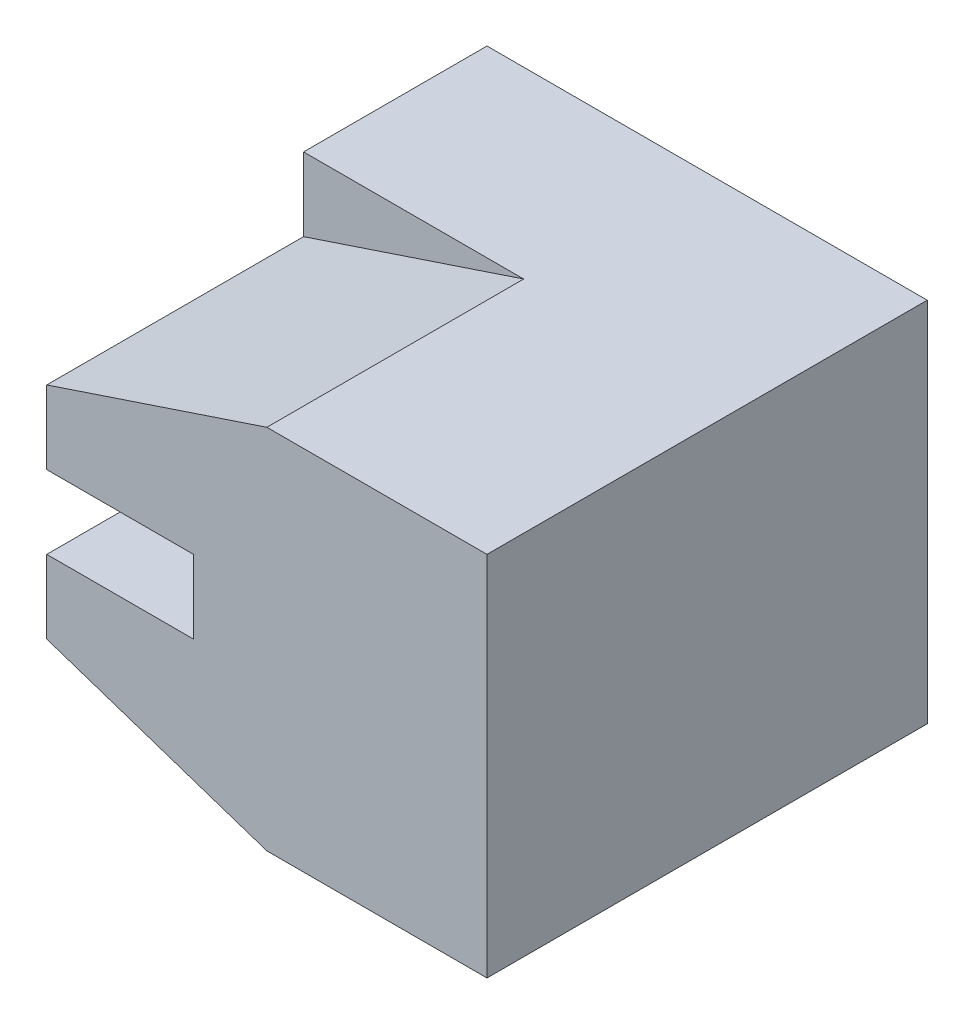
ISO-10303-21;
HEADER;
FILE_DESCRIPTION(('STEP AP214'),'2;1');
FILE_NAME('part.step','',(''),(''),'','','');
FILE_SCHEMA(('AUTOMOTIVE_DESIGN { 1 0 10303 214 1 1 1 1 }'));
ENDSEC;
DATA;
#1=APPLICATION_CONTEXT('core data for automotive mechanical design processes');
#2=APPLICATION_PROTOCOL_DEFINITION('international standard','automotive_design',2000,#1);
#3=PRODUCT_CONTEXT('',#1,'mechanical');
#4=PRODUCT('Part','Part','',(#3));
#5=PRODUCT_RELATED_PRODUCT_CATEGORY('part','',(#4));
#6=PRODUCT_DEFINITION_FORMATION('','',#4);
#7=PRODUCT_DEFINITION_CONTEXT('part definition',#1,'design');
#8=PRODUCT_DEFINITION('design','',#6,#7);
#9=PRODUCT_DEFINITION_SHAPE('','',#8);
#10=(LENGTH_UNIT() NAMED_UNIT(*) SI_UNIT(.MILLI.,.METRE.));
#11=(NAMED_UNIT(*) PLANE_ANGLE_UNIT() SI_UNIT($,.RADIAN.));
#12=(NAMED_UNIT(*) SI_UNIT($,.STERADIAN.) SOLID_ANGLE_UNIT());
#13=UNCERTAINTY_MEASURE_WITH_UNIT(LENGTH_MEASURE(1.E-05),#10,'distance_accuracy_value','');
#14=(GEOMETRIC_REPRESENTATION_CONTEXT(3) GLOBAL_UNCERTAINTY_ASSIGNED_CONTEXT((#13)) GLOBAL_UNIT_ASSIGNED_CONTEXT((#10,
#11,#12)) REPRESENTATION_CONTEXT('',''));
#15=CARTESIAN_POINT('',(0.,0.,0.));
#16=DIRECTION('',(0.,0.,1.));
#17=DIRECTION('',(1.,0.,0.));
#18=AXIS2_PLACEMENT_3D('',#15,#16,#17);
#19=CARTESIAN_POINT('',(-3.,5.,3.));
#20=DIRECTION('',(1.,0.,0.));
#21=DIRECTION('',(0.,0.,-1.));
#22=AXIS2_PLACEMENT_3D('',#19,#20,#21);
#23=PLANE('',#22);
#24=DIRECTION('',(0.,-1.,0.));
#25=VECTOR('',#24,1.);
#26=CARTESIAN_POINT('',(-3.,5.,3.));
#27=LINE('',#26,#25);
#28=CARTESIAN_POINT('',(-3.,4.,3.));
#29=VERTEX_POINT('',#28);
#30=CARTESIAN_POINT('',(-3.,3.,3.));
#31=VERTEX_POINT('',#30);
#32=EDGE_CURVE('E141',#29,#31,#27,.T.);
#33=ORIENTED_EDGE('',*,*,#32,.F.);
#34=DIRECTION('',(0.,0.,1.));
#35=VECTOR('',#34,1.);
#36=CARTESIAN_POINT('',(-3.,4.,-0.5));
#37=LINE('',#36,#35);
#38=CARTESIAN_POINT('',(-3.,4.,-0.5));
#39=VERTEX_POINT('',#38);
#40=EDGE_CURVE('E124',#39,#29,#37,.T.);
#41=ORIENTED_EDGE('',*,*,#40,.F.);
#42=DIRECTION('',(0.,-1.,0.));
#43=VECTOR('',#42,1.);
#44=CARTESIAN_POINT('',(-3.,0.,-0.5));
#45=LINE('',#44,#43);
#46=CARTESIAN_POINT('',(-3.,5.,-0.5));
#47=VERTEX_POINT('',#46);
#48=EDGE_CURVE('E130',#47,#39,#45,.T.);
#49=ORIENTED_EDGE('',*,*,#48,.F.);
#50=DIRECTION('',(0.,0.,1.));
#51=VECTOR('',#50,1.);
#52=CARTESIAN_POINT('',(-3.,5.,3.));
#53=LINE('',#52,#51);
#54=CARTESIAN_POINT('',(-3.,5.,-3.));
#55=VERTEX_POINT('',#54);
#56=EDGE_CURVE('E192',#55,#47,#53,.T.);
#57=ORIENTED_EDGE('',*,*,#56,.F.);
#58=DIRECTION('',(0.,-1.,0.));
#59=VECTOR('',#58,1.);
#60=CARTESIAN_POINT('',(-3.,5.,-3.));
#61=LINE('',#60,#59);
#62=CARTESIAN_POINT('',(-3.,0.,-3.));
#63=VERTEX_POINT('',#62);
#64=EDGE_CURVE('E41',#55,#63,#61,.T.);
#65=ORIENTED_EDGE('',*,*,#64,.T.);
#66=DIRECTION('',(0.,0.,1.));
#67=VECTOR('',#66,1.);
#68=CARTESIAN_POINT('',(-3.,0.,3.));
#69=LINE('',#68,#67);
#70=CARTESIAN_POINT('',(-3.,0.,-0.5));
#71=VERTEX_POINT('',#70);
#72=EDGE_CURVE('E201',#63,#71,#69,.T.);
#73=ORIENTED_EDGE('',*,*,#72,.T.);
#74=DIRECTION('',(0.,-1.,0.));
#75=VECTOR('',#74,1.);
#76=CARTESIAN_POINT('',(-3.,0.,-0.5));
#77=LINE('',#76,#75);
#78=CARTESIAN_POINT('',(-3.,1.,-0.5));
#79=VERTEX_POINT('',#78);
#80=EDGE_CURVE('E56',#79,#71,#77,.T.);
#81=ORIENTED_EDGE('',*,*,#80,.F.);
#82=DIRECTION('',(0.,0.,1.));
#83=VECTOR('',#82,1.);
#84=CARTESIAN_POINT('',(-3.,1.,-0.5));
#85=LINE('',#84,#83);
#86=CARTESIAN_POINT('',(-3.,1.,3.));
#87=VERTEX_POINT('',#86);
#88=EDGE_CURVE('E156',#79,#87,#85,.T.);
#89=ORIENTED_EDGE('',*,*,#88,.T.);
#90=CARTESIAN_POINT('',(-3.,2.,3.));
#91=VERTEX_POINT('',#90);
#92=EDGE_CURVE('E207',#91,#87,#27,.T.);
#93=ORIENTED_EDGE('',*,*,#92,.F.);
#94=DIRECTION('',(0.,0.,1.));
#95=VECTOR('',#94,1.);
#96=CARTESIAN_POINT('',(-3.,2.,0.));
#97=LINE('',#96,#95);
#98=CARTESIAN_POINT('',(-3.,2.,-0.500000000000001));
#99=VERTEX_POINT('',#98);
#100=EDGE_CURVE('E163',#99,#91,#97,.T.);
#101=ORIENTED_EDGE('',*,*,#100,.F.);
#102=DIRECTION('',(0.,1.,0.));
#103=VECTOR('',#102,1.);
#104=CARTESIAN_POINT('',(-3.,0.,-0.500000000000001));
#105=LINE('',#104,#103);
#106=CARTESIAN_POINT('',(-3.,3.,-0.500000000000001));
#107=VERTEX_POINT('',#106);
#108=EDGE_CURVE('E172',#99,#107,#105,.T.);
#109=ORIENTED_EDGE('',*,*,#108,.T.);
#110=DIRECTION('',(0.,0.,1.));
#111=VECTOR('',#110,1.);
#112=CARTESIAN_POINT('',(-3.,3.,0.));
#113=LINE('',#112,#111);
#114=EDGE_CURVE('E143',#107,#31,#113,.T.);
#115=ORIENTED_EDGE('',*,*,#114,.T.);
#116=EDGE_LOOP('',(#33,#41,#49,#57,#65,#73,#81,#89,#93,#101,#109,#115));
#117=FACE_BOUND('',#116,.T.);
#118=ADVANCED_FACE('F33',(#117),#23,.F.);
#119=CARTESIAN_POINT('',(-3.,5.,3.));
#120=DIRECTION('',(0.,0.,-1.));
#121=DIRECTION('',(-1.,0.,0.));
#122=AXIS2_PLACEMENT_3D('',#119,#120,#121);
#123=PLANE('',#122);
#124=DIRECTION('',(1.,0.,0.));
#125=VECTOR('',#124,1.);
#126=CARTESIAN_POINT('',(-3.,5.,3.));
#127=LINE('',#126,#125);
#128=CARTESIAN_POINT('',(0.,5.,3.));
#129=VERTEX_POINT('',#128);
#130=CARTESIAN_POINT('',(3.,5.,3.));
#131=VERTEX_POINT('',#130);
#132=EDGE_CURVE('E194',#129,#131,#127,.T.);
#133=ORIENTED_EDGE('',*,*,#132,.F.);
#134=DIRECTION('',(0.948683298050514,0.316227766016838,0.));
#135=VECTOR('',#134,1.);
#136=CARTESIAN_POINT('',(-1.5,4.5,3.));
#137=LINE('',#136,#135);
#138=EDGE_CURVE('E137',#29,#129,#137,.T.);
#139=ORIENTED_EDGE('',*,*,#138,.F.);
#140=ORIENTED_EDGE('',*,*,#32,.T.);
#141=DIRECTION('',(-1.,0.,0.));
#142=VECTOR('',#141,1.);
#143=CARTESIAN_POINT('',(-1.,3.,3.));
#144=LINE('',#143,#142);
#145=CARTESIAN_POINT('',(-1.,3.,3.));
#146=VERTEX_POINT('',#145);
#147=EDGE_CURVE('E176',#146,#31,#144,.T.);
#148=ORIENTED_EDGE('',*,*,#147,.F.);
#149=DIRECTION('',(0.,1.,0.));
#150=VECTOR('',#149,1.);
#151=CARTESIAN_POINT('',(-1.,0.,3.));
#152=LINE('',#151,#150);
#153=CARTESIAN_POINT('',(-1.,2.,3.));
#154=VERTEX_POINT('',#153);
#155=EDGE_CURVE('E167',#154,#146,#152,.T.);
#156=ORIENTED_EDGE('',*,*,#155,.F.);
#157=DIRECTION('',(-1.,0.,0.));
#158=VECTOR('',#157,1.);
#159=CARTESIAN_POINT('',(-1.,2.,3.));
#160=LINE('',#159,#158);
#161=EDGE_CURVE('E180',#154,#91,#160,.T.);
#162=ORIENTED_EDGE('',*,*,#161,.T.);
#163=ORIENTED_EDGE('',*,*,#92,.T.);
#164=DIRECTION('',(-0.948683298050514,0.316227766016838,0.));
#165=VECTOR('',#164,1.);
#166=CARTESIAN_POINT('',(0.,0.,3.));
#167=LINE('',#166,#165);
#168=CARTESIAN_POINT('',(0.,0.,3.));
#169=VERTEX_POINT('',#168);
#170=EDGE_CURVE('E151',#169,#87,#167,.T.);
#171=ORIENTED_EDGE('',*,*,#170,.F.);
#172=DIRECTION('',(1.,0.,0.));
#173=VECTOR('',#172,1.);
#174=CARTESIAN_POINT('',(-3.,0.,3.));
#175=LINE('',#174,#173);
#176=CARTESIAN_POINT('',(3.,0.,3.));
#177=VERTEX_POINT('',#176);
#178=EDGE_CURVE('E190',#169,#177,#175,.T.);
#179=ORIENTED_EDGE('',*,*,#178,.T.);
#180=DIRECTION('',(0.,-1.,0.));
#181=VECTOR('',#180,1.);
#182=CARTESIAN_POINT('',(3.,5.,3.));
#183=LINE('',#182,#181);
#184=EDGE_CURVE('E196',#131,#177,#183,.T.);
#185=ORIENTED_EDGE('',*,*,#184,.F.);
#186=EDGE_LOOP('',(#133,#139,#140,#148,#156,#162,#163,#171,#179,#185));
#187=FACE_BOUND('',#186,.T.);
#188=ADVANCED_FACE('F225',(#187),#123,.F.);
#189=CARTESIAN_POINT('',(3.,5.,3.));
#190=DIRECTION('',(-1.,0.,0.));
#191=DIRECTION('',(0.,0.,1.));
#192=AXIS2_PLACEMENT_3D('',#189,#190,#191);
#193=PLANE('',#192);
#194=DIRECTION('',(0.,0.,-1.));
#195=VECTOR('',#194,1.);
#196=CARTESIAN_POINT('',(3.,0.,3.));
#197=LINE('',#196,#195);
#198=CARTESIAN_POINT('',(3.,0.,-3.));
#199=VERTEX_POINT('',#198);
#200=EDGE_CURVE('E179',#177,#199,#197,.T.);
#201=ORIENTED_EDGE('',*,*,#200,.T.);
#202=DIRECTION('',(0.,-1.,0.));
#203=VECTOR('',#202,1.);
#204=CARTESIAN_POINT('',(3.,5.,-3.));
#205=LINE('',#204,#203);
#206=CARTESIAN_POINT('',(3.,5.,-3.));
#207=VERTEX_POINT('',#206);
#208=EDGE_CURVE('E11',#207,#199,#205,.T.);
#209=ORIENTED_EDGE('',*,*,#208,.F.);
#210=DIRECTION('',(0.,0.,-1.));
#211=VECTOR('',#210,1.);
#212=CARTESIAN_POINT('',(3.,5.,3.));
#213=LINE('',#212,#211);
#214=EDGE_CURVE('E186',#131,#207,#213,.T.);
#215=ORIENTED_EDGE('',*,*,#214,.F.);
#216=ORIENTED_EDGE('',*,*,#184,.T.);
#217=EDGE_LOOP('',(#201,#209,#215,#216));
#218=FACE_BOUND('',#217,.T.);
#219=ADVANCED_FACE('F35',(#218),#193,.F.);
#220=CARTESIAN_POINT('',(-3.,5.,-3.));
#221=DIRECTION('',(0.,0.,1.));
#222=DIRECTION('',(1.,0.,0.));
#223=AXIS2_PLACEMENT_3D('',#220,#221,#222);
#224=PLANE('',#223);
#225=DIRECTION('',(-1.,0.,0.));
#226=VECTOR('',#225,1.);
#227=CARTESIAN_POINT('',(-3.,0.,-3.));
#228=LINE('',#227,#226);
#229=EDGE_CURVE('E199',#199,#63,#228,.T.);
#230=ORIENTED_EDGE('',*,*,#229,.T.);
#231=ORIENTED_EDGE('',*,*,#64,.F.);
#232=DIRECTION('',(-1.,0.,0.));
#233=VECTOR('',#232,1.);
#234=CARTESIAN_POINT('',(-3.,5.,-3.));
#235=LINE('',#234,#233);
#236=EDGE_CURVE('E189',#207,#55,#235,.T.);
#237=ORIENTED_EDGE('',*,*,#236,.F.);
#238=ORIENTED_EDGE('',*,*,#208,.T.);
#239=EDGE_LOOP('',(#230,#231,#237,#238));
#240=FACE_BOUND('',#239,.T.);
#241=ADVANCED_FACE('F246',(#240),#224,.F.);
#242=CARTESIAN_POINT('',(0.,5.,0.));
#243=DIRECTION('',(0.,-1.,0.));
#244=DIRECTION('',(0.,0.,-1.));
#245=AXIS2_PLACEMENT_3D('',#242,#243,#244);
#246=PLANE('',#245);
#247=DIRECTION('',(-1.,0.,0.));
#248=VECTOR('',#247,1.);
#249=CARTESIAN_POINT('',(0.,5.,-0.5));
#250=LINE('',#249,#248);
#251=CARTESIAN_POINT('',(0.,5.,-0.5));
#252=VERTEX_POINT('',#251);
#253=EDGE_CURVE('E129',#252,#47,#250,.T.);
#254=ORIENTED_EDGE('',*,*,#253,.F.);
#255=DIRECTION('',(0.,0.,1.));
#256=VECTOR('',#255,1.);
#257=CARTESIAN_POINT('',(0.,5.,-0.5));
#258=LINE('',#257,#256);
#259=EDGE_CURVE('E127',#252,#129,#258,.T.);
#260=ORIENTED_EDGE('',*,*,#259,.T.);
#261=ORIENTED_EDGE('',*,*,#132,.T.);
#262=ORIENTED_EDGE('',*,*,#214,.T.);
#263=ORIENTED_EDGE('',*,*,#236,.T.);
#264=ORIENTED_EDGE('',*,*,#56,.T.);
#265=EDGE_LOOP('',(#254,#260,#261,#262,#263,#264));
#266=FACE_BOUND('',#265,.T.);
#267=ADVANCED_FACE('F243',(#266),#246,.F.);
#268=CARTESIAN_POINT('',(0.,0.,0.));
#269=DIRECTION('',(0.,-1.,0.));
#270=DIRECTION('',(0.,0.,-1.));
#271=AXIS2_PLACEMENT_3D('',#268,#269,#270);
#272=PLANE('',#271);
#273=DIRECTION('',(0.,0.,1.));
#274=VECTOR('',#273,1.);
#275=CARTESIAN_POINT('',(0.,0.,-0.5));
#276=LINE('',#275,#274);
#277=CARTESIAN_POINT('',(0.,0.,-0.5));
#278=VERTEX_POINT('',#277);
#279=EDGE_CURVE('E154',#278,#169,#276,.T.);
#280=ORIENTED_EDGE('',*,*,#279,.F.);
#281=DIRECTION('',(1.,0.,0.));
#282=VECTOR('',#281,1.);
#283=CARTESIAN_POINT('',(0.,0.,-0.5));
#284=LINE('',#283,#282);
#285=EDGE_CURVE('E148',#71,#278,#284,.T.);
#286=ORIENTED_EDGE('',*,*,#285,.F.);
#287=ORIENTED_EDGE('',*,*,#72,.F.);
#288=ORIENTED_EDGE('',*,*,#229,.F.);
#289=ORIENTED_EDGE('',*,*,#200,.F.);
#290=ORIENTED_EDGE('',*,*,#178,.F.);
#291=EDGE_LOOP('',(#280,#286,#287,#288,#289,#290));
#292=FACE_BOUND('',#291,.T.);
#293=ADVANCED_FACE('F214',(#292),#272,.T.);
#294=CARTESIAN_POINT('',(-1.,3.,0.));
#295=DIRECTION('',(0.,-1.,0.));
#296=DIRECTION('',(0.,0.,-1.));
#297=AXIS2_PLACEMENT_3D('',#294,#295,#296);
#298=PLANE('',#297);
#299=ORIENTED_EDGE('',*,*,#114,.F.);
#300=DIRECTION('',(-1.,0.,0.));
#301=VECTOR('',#300,1.);
#302=CARTESIAN_POINT('',(-1.,3.,-0.500000000000001));
#303=LINE('',#302,#301);
#304=CARTESIAN_POINT('',(-1.,3.,-0.500000000000001));
#305=VERTEX_POINT('',#304);
#306=EDGE_CURVE('E170',#305,#107,#303,.T.);
#307=ORIENTED_EDGE('',*,*,#306,.F.);
#308=DIRECTION('',(0.,0.,1.));
#309=VECTOR('',#308,1.);
#310=CARTESIAN_POINT('',(-1.,3.,0.));
#311=LINE('',#310,#309);
#312=EDGE_CURVE('E160',#305,#146,#311,.T.);
#313=ORIENTED_EDGE('',*,*,#312,.T.);
#314=ORIENTED_EDGE('',*,*,#147,.T.);
#315=EDGE_LOOP('',(#299,#307,#313,#314));
#316=FACE_BOUND('',#315,.T.);
#317=ADVANCED_FACE('F240',(#316),#298,.T.);
#318=CARTESIAN_POINT('',(-1.,2.,0.));
#319=DIRECTION('',(0.,-1.,0.));
#320=DIRECTION('',(0.,0.,-1.));
#321=AXIS2_PLACEMENT_3D('',#318,#319,#320);
#322=PLANE('',#321);
#323=ORIENTED_EDGE('',*,*,#100,.T.);
#324=ORIENTED_EDGE('',*,*,#161,.F.);
#325=DIRECTION('',(0.,0.,1.));
#326=VECTOR('',#325,1.);
#327=CARTESIAN_POINT('',(-1.,2.,0.));
#328=LINE('',#327,#326);
#329=CARTESIAN_POINT('',(-1.,2.,-0.500000000000001));
#330=VERTEX_POINT('',#329);
#331=EDGE_CURVE('E165',#330,#154,#328,.T.);
#332=ORIENTED_EDGE('',*,*,#331,.F.);
#333=DIRECTION('',(-1.,0.,0.));
#334=VECTOR('',#333,1.);
#335=CARTESIAN_POINT('',(-1.,2.,-0.500000000000001));
#336=LINE('',#335,#334);
#337=EDGE_CURVE('E183',#330,#99,#336,.T.);
#338=ORIENTED_EDGE('',*,*,#337,.T.);
#339=EDGE_LOOP('',(#323,#324,#332,#338));
#340=FACE_BOUND('',#339,.T.);
#341=ADVANCED_FACE('F231',(#340),#322,.F.);
#342=CARTESIAN_POINT('',(-1.,0.,-0.500000000000001));
#343=DIRECTION('',(0.,0.,1.));
#344=DIRECTION('',(1.,0.,0.));
#345=AXIS2_PLACEMENT_3D('',#342,#343,#344);
#346=PLANE('',#345);
#347=ORIENTED_EDGE('',*,*,#108,.F.);
#348=ORIENTED_EDGE('',*,*,#337,.F.);
#349=DIRECTION('',(0.,1.,0.));
#350=VECTOR('',#349,1.);
#351=CARTESIAN_POINT('',(-1.,0.,-0.500000000000001));
#352=LINE('',#351,#350);
#353=EDGE_CURVE('E162',#330,#305,#352,.T.);
#354=ORIENTED_EDGE('',*,*,#353,.T.);
#355=ORIENTED_EDGE('',*,*,#306,.T.);
#356=EDGE_LOOP('',(#347,#348,#354,#355));
#357=FACE_BOUND('',#356,.T.);
#358=ADVANCED_FACE('F235',(#357),#346,.T.);
#359=CARTESIAN_POINT('',(-1.,0.,0.));
#360=DIRECTION('',(-1.,0.,0.));
#361=DIRECTION('',(0.,0.,1.));
#362=AXIS2_PLACEMENT_3D('',#359,#360,#361);
#363=PLANE('',#362);
#364=ORIENTED_EDGE('',*,*,#312,.F.);
#365=ORIENTED_EDGE('',*,*,#353,.F.);
#366=ORIENTED_EDGE('',*,*,#331,.T.);
#367=ORIENTED_EDGE('',*,*,#155,.T.);
#368=EDGE_LOOP('',(#364,#365,#366,#367));
#369=FACE_BOUND('',#368,.T.);
#370=ADVANCED_FACE('F267',(#369),#363,.T.);
#371=CARTESIAN_POINT('',(0.,0.,-0.5));
#372=DIRECTION('',(0.316227766016838,0.948683298050514,0.));
#373=DIRECTION('',(-0.948683298050514,0.316227766016838,0.));
#374=AXIS2_PLACEMENT_3D('',#371,#372,#373);
#375=PLANE('',#374);
#376=ORIENTED_EDGE('',*,*,#170,.T.);
#377=ORIENTED_EDGE('',*,*,#88,.F.);
#378=DIRECTION('',(-0.948683298050514,0.316227766016838,0.));
#379=VECTOR('',#378,1.);
#380=CARTESIAN_POINT('',(0.,0.,-0.5));
#381=LINE('',#380,#379);
#382=EDGE_CURVE('E150',#278,#79,#381,.T.);
#383=ORIENTED_EDGE('',*,*,#382,.F.);
#384=ORIENTED_EDGE('',*,*,#279,.T.);
#385=EDGE_LOOP('',(#376,#377,#383,#384));
#386=FACE_BOUND('',#385,.T.);
#387=ADVANCED_FACE('F272',(#386),#375,.F.);
#388=CARTESIAN_POINT('',(0.,0.,-0.5));
#389=DIRECTION('',(0.,0.,1.));
#390=DIRECTION('',(1.,0.,0.));
#391=AXIS2_PLACEMENT_3D('',#388,#389,#390);
#392=PLANE('',#391);
#393=ORIENTED_EDGE('',*,*,#285,.T.);
#394=ORIENTED_EDGE('',*,*,#382,.T.);
#395=ORIENTED_EDGE('',*,*,#80,.T.);
#396=EDGE_LOOP('',(#393,#394,#395));
#397=FACE_BOUND('',#396,.T.);
#398=ADVANCED_FACE('F217',(#397),#392,.T.);
#399=CARTESIAN_POINT('',(-1.5,4.5,-0.5));
#400=DIRECTION('',(0.316227766016838,-0.948683298050514,0.));
#401=DIRECTION('',(0.948683298050514,0.316227766016838,0.));
#402=AXIS2_PLACEMENT_3D('',#399,#400,#401);
#403=PLANE('',#402);
#404=ORIENTED_EDGE('',*,*,#138,.T.);
#405=ORIENTED_EDGE('',*,*,#259,.F.);
#406=DIRECTION('',(0.948683298050514,0.316227766016838,0.));
#407=VECTOR('',#406,1.);
#408=CARTESIAN_POINT('',(-1.5,4.5,-0.5));
#409=LINE('',#408,#407);
#410=EDGE_CURVE('E48',#39,#252,#409,.T.);
#411=ORIENTED_EDGE('',*,*,#410,.F.);
#412=ORIENTED_EDGE('',*,*,#40,.T.);
#413=EDGE_LOOP('',(#404,#405,#411,#412));
#414=FACE_BOUND('',#413,.T.);
#415=ADVANCED_FACE('F122',(#414),#403,.F.);
#416=CARTESIAN_POINT('',(0.,0.,-0.5));
#417=DIRECTION('',(0.,0.,1.));
#418=DIRECTION('',(1.,0.,0.));
#419=AXIS2_PLACEMENT_3D('',#416,#417,#418);
#420=PLANE('',#419);
#421=ORIENTED_EDGE('',*,*,#48,.T.);
#422=ORIENTED_EDGE('',*,*,#410,.T.);
#423=ORIENTED_EDGE('',*,*,#253,.T.);
#424=EDGE_LOOP('',(#421,#422,#423));
#425=FACE_BOUND('',#424,.T.);
#426=ADVANCED_FACE('F133',(#425),#420,.T.);
#427=CLOSED_SHELL('',(#118,#188,#219,#241,#267,#293,#317,#341,#358,#370,#387,#398,#415,#426));
#428=MANIFOLD_SOLID_BREP('B2',#427);
#429=ADVANCED_BREP_SHAPE_REPRESENTATION('',(#18,#428),#14);
#430=SHAPE_DEFINITION_REPRESENTATION(#9,#429);
ENDSEC;
END-ISO-10303-21;
